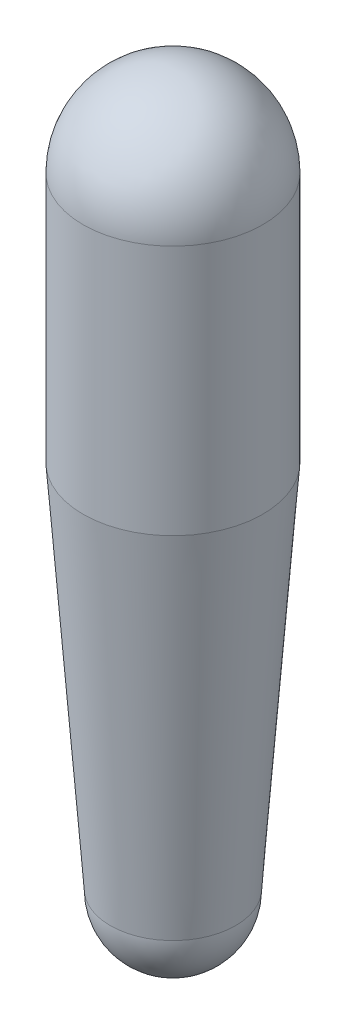
ISO-10303-21;
HEADER;
FILE_DESCRIPTION(('STEP AP214'),'2;1');
FILE_NAME('part.step','',(''),(''),'','','');
FILE_SCHEMA(('AUTOMOTIVE_DESIGN { 1 0 10303 214 1 1 1 1 }'));
ENDSEC;
DATA;
#1=APPLICATION_CONTEXT('core data for automotive mechanical design processes');
#2=APPLICATION_PROTOCOL_DEFINITION('international standard','automotive_design',2000,#1);
#3=PRODUCT_CONTEXT('',#1,'mechanical');
#4=PRODUCT('Part','Part','',(#3));
#5=PRODUCT_RELATED_PRODUCT_CATEGORY('part','',(#4));
#6=PRODUCT_DEFINITION_FORMATION('','',#4);
#7=PRODUCT_DEFINITION_CONTEXT('part definition',#1,'design');
#8=PRODUCT_DEFINITION('design','',#6,#7);
#9=PRODUCT_DEFINITION_SHAPE('','',#8);
#10=(LENGTH_UNIT() NAMED_UNIT(*) SI_UNIT(.MILLI.,.METRE.));
#11=(NAMED_UNIT(*) PLANE_ANGLE_UNIT() SI_UNIT($,.RADIAN.));
#12=(NAMED_UNIT(*) SI_UNIT($,.STERADIAN.) SOLID_ANGLE_UNIT());
#13=UNCERTAINTY_MEASURE_WITH_UNIT(LENGTH_MEASURE(1.E-05),#10,'distance_accuracy_value','');
#14=(GEOMETRIC_REPRESENTATION_CONTEXT(3) GLOBAL_UNCERTAINTY_ASSIGNED_CONTEXT((#13)) GLOBAL_UNIT_ASSIGNED_CONTEXT((#10,
#11,#12)) REPRESENTATION_CONTEXT('',''));
#15=CARTESIAN_POINT('',(0.,0.,0.));
#16=DIRECTION('',(0.,0.,1.));
#17=DIRECTION('',(1.,0.,0.));
#18=AXIS2_PLACEMENT_3D('',#15,#16,#17);
#19=CARTESIAN_POINT('',(0.,0.,0.));
#20=DIRECTION('',(-1.,0.,0.));
#21=DIRECTION('',(0.,1.,0.));
#22=AXIS2_PLACEMENT_3D('',#19,#20,#21);
#23=SPHERICAL_SURFACE('',#22,54.61);
#24=CARTESIAN_POINT('',(0.,0.,0.));
#25=DIRECTION('',(0.,1.,0.));
#26=DIRECTION('',(0.,0.,1.));
#27=AXIS2_PLACEMENT_3D('',#24,#25,#26);
#28=SPHERICAL_SURFACE('',#27,54.61);
#29=CARTESIAN_POINT('',(0.,0.,0.));
#30=DIRECTION('',(0.,1.,0.));
#31=DIRECTION('',(0.,0.,1.));
#32=AXIS2_PLACEMENT_3D('',#29,#30,#31);
#33=CIRCLE('',#32,54.61);
#34=CARTESIAN_POINT('',(0.,0.,54.61));
#35=VERTEX_POINT('',#34);
#36=EDGE_CURVE('E10',#35,#35,#33,.F.);
#37=ORIENTED_EDGE('',*,*,#36,.F.);
#38=EDGE_LOOP('',(#37));
#39=FACE_BOUND('',#38,.T.);
#40=ADVANCED_FACE('F14',(#39),#28,.T.);
#41=CARTESIAN_POINT('',(0.,-377.19,0.));
#42=DIRECTION('',(0.,1.,0.));
#43=DIRECTION('',(0.,0.,1.));
#44=AXIS2_PLACEMENT_3D('',#41,#42,#43);
#45=CONICAL_SURFACE('',#44,38.1,0.0733146881032708);
#46=CARTESIAN_POINT('',(0.,-152.4,0.));
#47=DIRECTION('',(0.,1.,0.));
#48=DIRECTION('',(0.,0.,1.));
#49=AXIS2_PLACEMENT_3D('',#46,#47,#48);
#50=CIRCLE('',#49,54.61);
#51=CARTESIAN_POINT('',(0.,-152.4,54.6100000000001));
#52=VERTEX_POINT('',#51);
#53=EDGE_CURVE('E20',#52,#52,#50,.T.);
#54=ORIENTED_EDGE('',*,*,#53,.F.);
#55=EDGE_LOOP('',(#54));
#56=FACE_BOUND('',#55,.T.);
#57=CARTESIAN_POINT('',(0.,-377.190000000009,0.));
#58=DIRECTION('',(0.,-1.,0.));
#59=DIRECTION('',(0.,0.,-1.));
#60=AXIS2_PLACEMENT_3D('',#57,#58,#59);
#61=CIRCLE('',#60,38.0999999999994);
#62=CARTESIAN_POINT('',(0.,-377.190000000009,-38.0999999999993));
#63=VERTEX_POINT('',#62);
#64=EDGE_CURVE('E24',#63,#63,#61,.F.);
#65=ORIENTED_EDGE('',*,*,#64,.T.);
#66=EDGE_LOOP('',(#65));
#67=FACE_BOUND('',#66,.T.);
#68=ADVANCED_FACE('F31',(#56,#67),#45,.T.);
#69=CARTESIAN_POINT('',(0.,0.,0.));
#70=DIRECTION('',(0.,1.,0.));
#71=DIRECTION('',(0.,0.,1.));
#72=AXIS2_PLACEMENT_3D('',#69,#70,#71);
#73=CYLINDRICAL_SURFACE('',#72,54.61);
#74=ORIENTED_EDGE('',*,*,#36,.T.);
#75=EDGE_LOOP('',(#74));
#76=FACE_BOUND('',#75,.T.);
#77=ORIENTED_EDGE('',*,*,#53,.T.);
#78=EDGE_LOOP('',(#77));
#79=FACE_BOUND('',#78,.T.);
#80=ADVANCED_FACE('F35',(#76,#79),#73,.T.);
#81=CARTESIAN_POINT('',(0.,-377.19,0.));
#82=DIRECTION('',(-1.,0.,0.));
#83=DIRECTION('',(0.,1.,0.));
#84=AXIS2_PLACEMENT_3D('',#81,#82,#83);
#85=SPHERICAL_SURFACE('',#84,38.1);
#86=CARTESIAN_POINT('',(0.,-377.19,0.));
#87=DIRECTION('',(0.,-1.,0.));
#88=DIRECTION('',(0.,0.,-1.));
#89=AXIS2_PLACEMENT_3D('',#86,#87,#88);
#90=SPHERICAL_SURFACE('',#89,38.1);
#91=ORIENTED_EDGE('',*,*,#64,.F.);
#92=EDGE_LOOP('',(#91));
#93=FACE_BOUND('',#92,.T.);
#94=ADVANCED_FACE('F33',(#93),#90,.T.);
#95=CLOSED_SHELL('',(#40,#68,#80,#94));
#96=MANIFOLD_SOLID_BREP('B1',#95);
#97=ADVANCED_BREP_SHAPE_REPRESENTATION('',(#18,#96),#14);
#98=SHAPE_DEFINITION_REPRESENTATION(#9,#97);
ENDSEC;
END-ISO-10303-21;
